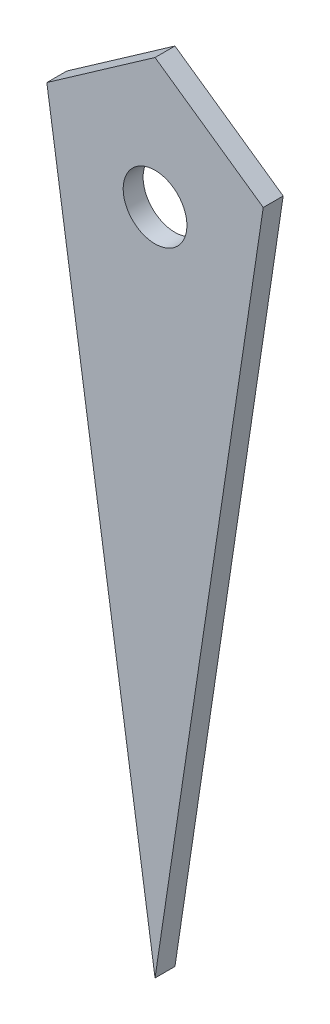
ISO-10303-21;
HEADER;
FILE_DESCRIPTION(('STEP AP214'),'2;1');
FILE_NAME('part.step','',(''),(''),'','','');
FILE_SCHEMA(('AUTOMOTIVE_DESIGN { 1 0 10303 214 1 1 1 1 }'));
ENDSEC;
DATA;
#1=APPLICATION_CONTEXT('core data for automotive mechanical design processes');
#2=APPLICATION_PROTOCOL_DEFINITION('international standard','automotive_design',2000,#1);
#3=PRODUCT_CONTEXT('',#1,'mechanical');
#4=PRODUCT('Part','Part','',(#3));
#5=PRODUCT_RELATED_PRODUCT_CATEGORY('part','',(#4));
#6=PRODUCT_DEFINITION_FORMATION('','',#4);
#7=PRODUCT_DEFINITION_CONTEXT('part definition',#1,'design');
#8=PRODUCT_DEFINITION('design','',#6,#7);
#9=PRODUCT_DEFINITION_SHAPE('','',#8);
#10=(LENGTH_UNIT() NAMED_UNIT(*) SI_UNIT(.MILLI.,.METRE.));
#11=(NAMED_UNIT(*) PLANE_ANGLE_UNIT() SI_UNIT($,.RADIAN.));
#12=(NAMED_UNIT(*) SI_UNIT($,.STERADIAN.) SOLID_ANGLE_UNIT());
#13=UNCERTAINTY_MEASURE_WITH_UNIT(LENGTH_MEASURE(1.E-05),#10,'distance_accuracy_value','');
#14=(GEOMETRIC_REPRESENTATION_CONTEXT(3) GLOBAL_UNCERTAINTY_ASSIGNED_CONTEXT((#13)) GLOBAL_UNIT_ASSIGNED_CONTEXT((#10,
#11,#12)) REPRESENTATION_CONTEXT('',''));
#15=CARTESIAN_POINT('',(0.,0.,0.));
#16=DIRECTION('',(0.,0.,1.));
#17=DIRECTION('',(1.,0.,0.));
#18=AXIS2_PLACEMENT_3D('',#15,#16,#17);
#19=CARTESIAN_POINT('',(60.,400.,10.));
#20=DIRECTION('',(0.988936352868298,-0.148340452930245,0.));
#21=DIRECTION('',(0.148340452930245,0.988936352868298,0.));
#22=AXIS2_PLACEMENT_3D('',#19,#20,#21);
#23=PLANE('',#22);
#24=DIRECTION('',(0.148340452930245,0.988936352868298,0.));
#25=VECTOR('',#24,1.);
#26=CARTESIAN_POINT('',(60.,400.,10.));
#27=LINE('',#26,#25);
#28=CARTESIAN_POINT('',(0.,0.,10.));
#29=VERTEX_POINT('',#28);
#30=CARTESIAN_POINT('',(54.2971128426798,361.980752284533,10.));
#31=VERTEX_POINT('',#30);
#32=EDGE_CURVE('E111',#29,#31,#27,.T.);
#33=ORIENTED_EDGE('',*,*,#32,.F.);
#34=DIRECTION('',(0.,0.,-1.));
#35=VECTOR('',#34,1.);
#36=CARTESIAN_POINT('',(0.,0.,10.));
#37=LINE('',#36,#35);
#38=CARTESIAN_POINT('',(0.,0.,0.));
#39=VERTEX_POINT('',#38);
#40=EDGE_CURVE('E11',#29,#39,#37,.T.);
#41=ORIENTED_EDGE('',*,*,#40,.T.);
#42=DIRECTION('',(0.148340452930245,0.988936352868298,0.));
#43=VECTOR('',#42,1.);
#44=CARTESIAN_POINT('',(60.,400.,0.));
#45=LINE('',#44,#43);
#46=CARTESIAN_POINT('',(54.2971128426798,361.980752284533,0.));
#47=VERTEX_POINT('',#46);
#48=EDGE_CURVE('E109',#39,#47,#45,.T.);
#49=ORIENTED_EDGE('',*,*,#48,.T.);
#50=DIRECTION('',(0.,0.,1.));
#51=VECTOR('',#50,1.);
#52=CARTESIAN_POINT('',(54.2971128426798,361.980752284533,0.));
#53=LINE('',#52,#51);
#54=EDGE_CURVE('E96',#47,#31,#53,.T.);
#55=ORIENTED_EDGE('',*,*,#54,.T.);
#56=EDGE_LOOP('',(#33,#41,#49,#55));
#57=FACE_BOUND('',#56,.T.);
#58=ADVANCED_FACE('F43',(#57),#23,.T.);
#59=CARTESIAN_POINT('',(0.,0.,10.));
#60=DIRECTION('',(0.,0.,-1.));
#61=DIRECTION('',(1.,0.,0.));
#62=AXIS2_PLACEMENT_3D('',#59,#60,#61);
#63=PLANE('',#62);
#64=CARTESIAN_POINT('',(0.,335.,10.));
#65=DIRECTION('',(0.,0.,-1.));
#66=DIRECTION('',(-1.,0.,0.));
#67=AXIS2_PLACEMENT_3D('',#64,#65,#66);
#68=CIRCLE('',#67,16.);
#69=CARTESIAN_POINT('',(-16.,335.,10.));
#70=VERTEX_POINT('',#69);
#71=EDGE_CURVE('E120',#70,#70,#68,.T.);
#72=ORIENTED_EDGE('',*,*,#71,.T.);
#73=EDGE_LOOP('',(#72));
#74=FACE_BOUND('',#73,.T.);
#75=DIRECTION('',(0.819152044288993,-0.573576436351044,0.));
#76=VECTOR('',#75,1.);
#77=CARTESIAN_POINT('',(187.938524157181,268.404028665135,10.));
#78=LINE('',#77,#76);
#79=CARTESIAN_POINT('',(2.65326929697669E-13,400.,10.));
#80=VERTEX_POINT('',#79);
#81=EDGE_CURVE('E100',#80,#31,#78,.T.);
#82=ORIENTED_EDGE('',*,*,#81,.F.);
#83=DIRECTION('',(-0.819152044288994,-0.573576436351044,0.));
#84=VECTOR('',#83,1.);
#85=CARTESIAN_POINT('',(-187.938524157181,268.404028665135,10.));
#86=LINE('',#85,#84);
#87=CARTESIAN_POINT('',(-54.2971128426799,361.980752284532,10.));
#88=VERTEX_POINT('',#87);
#89=EDGE_CURVE('E88',#80,#88,#86,.T.);
#90=ORIENTED_EDGE('',*,*,#89,.T.);
#91=DIRECTION('',(0.148340452930245,-0.988936352868298,0.));
#92=VECTOR('',#91,1.);
#93=CARTESIAN_POINT('',(0.,0.,10.));
#94=LINE('',#93,#92);
#95=EDGE_CURVE('E50',#88,#29,#94,.T.);
#96=ORIENTED_EDGE('',*,*,#95,.T.);
#97=ORIENTED_EDGE('',*,*,#32,.T.);
#98=EDGE_LOOP('',(#82,#90,#96,#97));
#99=FACE_BOUND('',#98,.T.);
#100=ADVANCED_FACE('F117',(#74,#99),#63,.F.);
#101=CARTESIAN_POINT('',(0.,0.,0.));
#102=DIRECTION('',(0.,0.,-1.));
#103=DIRECTION('',(1.,0.,0.));
#104=AXIS2_PLACEMENT_3D('',#101,#102,#103);
#105=PLANE('',#104);
#106=CARTESIAN_POINT('',(0.,335.,0.));
#107=DIRECTION('',(0.,0.,-1.));
#108=DIRECTION('',(-1.,0.,0.));
#109=AXIS2_PLACEMENT_3D('',#106,#107,#108);
#110=CIRCLE('',#109,16.);
#111=CARTESIAN_POINT('',(-16.,335.,0.));
#112=VERTEX_POINT('',#111);
#113=EDGE_CURVE('E118',#112,#112,#110,.T.);
#114=ORIENTED_EDGE('',*,*,#113,.F.);
#115=EDGE_LOOP('',(#114));
#116=FACE_BOUND('',#115,.T.);
#117=ORIENTED_EDGE('',*,*,#48,.F.);
#118=DIRECTION('',(0.148340452930245,-0.988936352868298,0.));
#119=VECTOR('',#118,1.);
#120=CARTESIAN_POINT('',(0.,0.,0.));
#121=LINE('',#120,#119);
#122=CARTESIAN_POINT('',(-54.2971128426799,361.980752284532,0.));
#123=VERTEX_POINT('',#122);
#124=EDGE_CURVE('E103',#123,#39,#121,.T.);
#125=ORIENTED_EDGE('',*,*,#124,.F.);
#126=DIRECTION('',(-0.819152044288994,-0.573576436351044,0.));
#127=VECTOR('',#126,1.);
#128=CARTESIAN_POINT('',(-187.938524157181,268.404028665135,0.));
#129=LINE('',#128,#127);
#130=CARTESIAN_POINT('',(2.65326929697669E-13,400.,0.));
#131=VERTEX_POINT('',#130);
#132=EDGE_CURVE('E86',#131,#123,#129,.T.);
#133=ORIENTED_EDGE('',*,*,#132,.F.);
#134=DIRECTION('',(0.819152044288993,-0.573576436351044,0.));
#135=VECTOR('',#134,1.);
#136=CARTESIAN_POINT('',(187.938524157181,268.404028665135,0.));
#137=LINE('',#136,#135);
#138=EDGE_CURVE('E93',#131,#47,#137,.T.);
#139=ORIENTED_EDGE('',*,*,#138,.T.);
#140=EDGE_LOOP('',(#117,#125,#133,#139));
#141=FACE_BOUND('',#140,.T.);
#142=ADVANCED_FACE('F102',(#116,#141),#105,.T.);
#143=CARTESIAN_POINT('',(0.,0.,10.));
#144=DIRECTION('',(-0.988936352868298,-0.148340452930245,0.));
#145=DIRECTION('',(0.148340452930245,-0.988936352868298,0.));
#146=AXIS2_PLACEMENT_3D('',#143,#144,#145);
#147=PLANE('',#146);
#148=DIRECTION('',(0.,0.,1.));
#149=VECTOR('',#148,1.);
#150=CARTESIAN_POINT('',(-54.2971128426799,361.980752284532,0.));
#151=LINE('',#150,#149);
#152=EDGE_CURVE('E57',#123,#88,#151,.T.);
#153=ORIENTED_EDGE('',*,*,#152,.F.);
#154=ORIENTED_EDGE('',*,*,#124,.T.);
#155=ORIENTED_EDGE('',*,*,#40,.F.);
#156=ORIENTED_EDGE('',*,*,#95,.F.);
#157=EDGE_LOOP('',(#153,#154,#155,#156));
#158=FACE_BOUND('',#157,.T.);
#159=ADVANCED_FACE('F114',(#158),#147,.T.);
#160=CARTESIAN_POINT('',(-187.938524157181,268.404028665135,0.));
#161=DIRECTION('',(0.573576436351044,-0.819152044288993,0.));
#162=DIRECTION('',(0.819152044288993,0.573576436351044,0.));
#163=AXIS2_PLACEMENT_3D('',#160,#161,#162);
#164=PLANE('',#163);
#165=ORIENTED_EDGE('',*,*,#89,.F.);
#166=DIRECTION('',(0.,0.,1.));
#167=VECTOR('',#166,1.);
#168=CARTESIAN_POINT('',(2.65326929697669E-13,400.,0.));
#169=LINE('',#168,#167);
#170=EDGE_CURVE('E82',#131,#80,#169,.T.);
#171=ORIENTED_EDGE('',*,*,#170,.F.);
#172=ORIENTED_EDGE('',*,*,#132,.T.);
#173=ORIENTED_EDGE('',*,*,#152,.T.);
#174=EDGE_LOOP('',(#165,#171,#172,#173));
#175=FACE_BOUND('',#174,.T.);
#176=ADVANCED_FACE('F84',(#175),#164,.F.);
#177=CARTESIAN_POINT('',(187.938524157181,268.404028665135,0.));
#178=DIRECTION('',(0.573576436351044,0.819152044288993,0.));
#179=DIRECTION('',(-0.819152044288993,0.573576436351044,0.));
#180=AXIS2_PLACEMENT_3D('',#177,#178,#179);
#181=PLANE('',#180);
#182=ORIENTED_EDGE('',*,*,#81,.T.);
#183=ORIENTED_EDGE('',*,*,#54,.F.);
#184=ORIENTED_EDGE('',*,*,#138,.F.);
#185=ORIENTED_EDGE('',*,*,#170,.T.);
#186=EDGE_LOOP('',(#182,#183,#184,#185));
#187=FACE_BOUND('',#186,.T.);
#188=ADVANCED_FACE('F94',(#187),#181,.T.);
#189=CARTESIAN_POINT('',(0.,335.,0.));
#190=DIRECTION('',(0.,0.,1.));
#191=DIRECTION('',(-1.,0.,0.));
#192=AXIS2_PLACEMENT_3D('',#189,#190,#191);
#193=CYLINDRICAL_SURFACE('',#192,16.);
#194=ORIENTED_EDGE('',*,*,#113,.T.);
#195=EDGE_LOOP('',(#194));
#196=FACE_BOUND('',#195,.T.);
#197=ORIENTED_EDGE('',*,*,#71,.F.);
#198=EDGE_LOOP('',(#197));
#199=FACE_BOUND('',#198,.T.);
#200=ADVANCED_FACE('F127',(#196,#199),#193,.F.);
#201=CLOSED_SHELL('',(#58,#100,#142,#159,#176,#188,#200));
#202=MANIFOLD_SOLID_BREP('B2',#201);
#203=ADVANCED_BREP_SHAPE_REPRESENTATION('',(#18,#202),#14);
#204=SHAPE_DEFINITION_REPRESENTATION(#9,#203);
ENDSEC;
END-ISO-10303-21;
